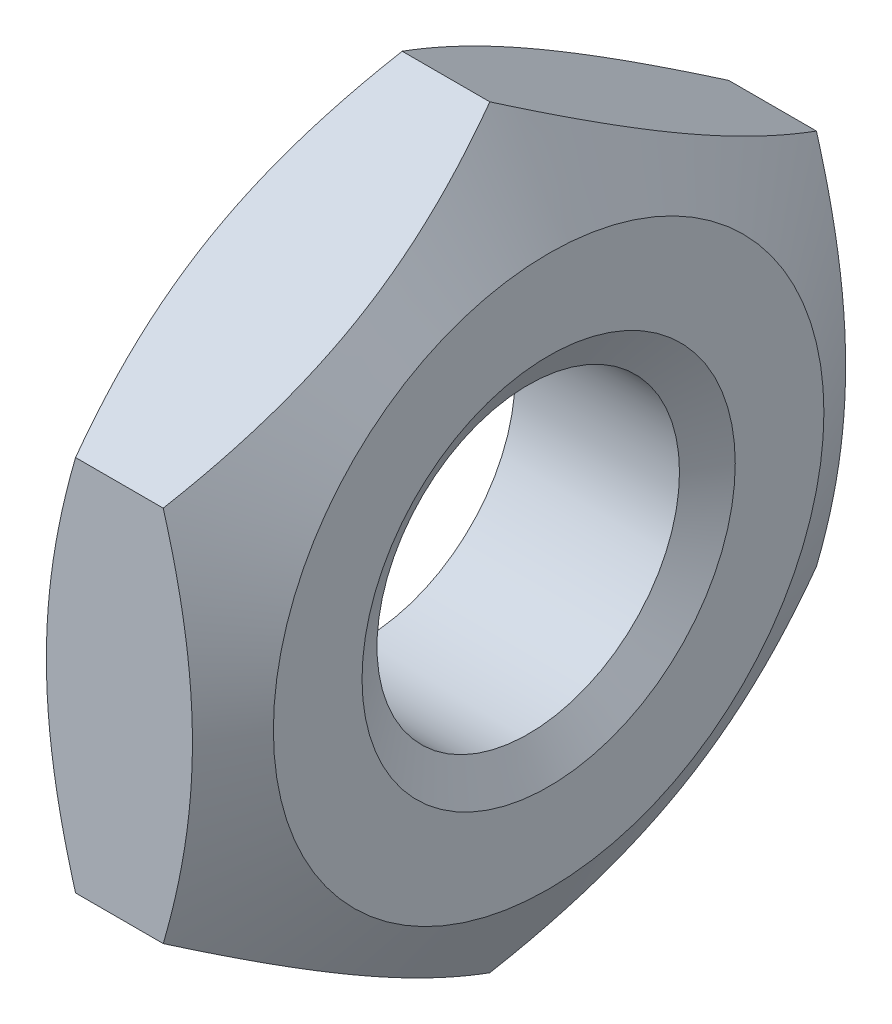
ISO-10303-21;
HEADER;
FILE_DESCRIPTION(('STEP AP214'),'2;1');
FILE_NAME('part.step','',(''),(''),'','','');
FILE_SCHEMA(('AUTOMOTIVE_DESIGN { 1 0 10303 214 1 1 1 1 }'));
ENDSEC;
DATA;
#1=APPLICATION_CONTEXT('core data for automotive mechanical design processes');
#2=APPLICATION_PROTOCOL_DEFINITION('international standard','automotive_design',2000,#1);
#3=PRODUCT_CONTEXT('',#1,'mechanical');
#4=PRODUCT('Part','Part','',(#3));
#5=PRODUCT_RELATED_PRODUCT_CATEGORY('part','',(#4));
#6=PRODUCT_DEFINITION_FORMATION('','',#4);
#7=PRODUCT_DEFINITION_CONTEXT('part definition',#1,'design');
#8=PRODUCT_DEFINITION('design','',#6,#7);
#9=PRODUCT_DEFINITION_SHAPE('','',#8);
#10=(LENGTH_UNIT() NAMED_UNIT(*) SI_UNIT(.MILLI.,.METRE.));
#11=(NAMED_UNIT(*) PLANE_ANGLE_UNIT() SI_UNIT($,.RADIAN.));
#12=(NAMED_UNIT(*) SI_UNIT($,.STERADIAN.) SOLID_ANGLE_UNIT());
#13=UNCERTAINTY_MEASURE_WITH_UNIT(LENGTH_MEASURE(1.E-05),#10,'distance_accuracy_value','');
#14=(GEOMETRIC_REPRESENTATION_CONTEXT(3) GLOBAL_UNCERTAINTY_ASSIGNED_CONTEXT((#13)) GLOBAL_UNIT_ASSIGNED_CONTEXT((#10,
#11,#12)) REPRESENTATION_CONTEXT('',''));
#15=CARTESIAN_POINT('',(0.,0.,0.));
#16=DIRECTION('',(0.,0.,1.));
#17=DIRECTION('',(1.,0.,0.));
#18=AXIS2_PLACEMENT_3D('',#15,#16,#17);
#19=CARTESIAN_POINT('',(0.,0.,0.));
#20=DIRECTION('',(1.,0.,0.));
#21=DIRECTION('',(0.,0.,-1.));
#22=AXIS2_PLACEMENT_3D('',#19,#20,#21);
#23=PLANE('',#22);
#24=CARTESIAN_POINT('',(5.68435272810253E-11,0.,0.));
#25=DIRECTION('',(1.,0.,0.));
#26=DIRECTION('',(0.,0.,-1.));
#27=AXIS2_PLACEMENT_3D('',#24,#25,#26);
#28=CIRCLE('',#27,2.9500000000553);
#29=CARTESIAN_POINT('',(5.68435272810253E-11,0.,-2.9500000000553));
#30=VERTEX_POINT('',#29);
#31=EDGE_CURVE('E241',#30,#30,#28,.T.);
#32=ORIENTED_EDGE('',*,*,#31,.F.);
#33=EDGE_LOOP('',(#32));
#34=FACE_BOUND('',#33,.T.);
#35=CARTESIAN_POINT('',(8.08682745444577E-11,0.,0.));
#36=DIRECTION('',(-1.,0.,0.));
#37=DIRECTION('',(0.,0.,1.));
#38=AXIS2_PLACEMENT_3D('',#35,#36,#37);
#39=CIRCLE('',#38,1.99988611427671);
#40=CARTESIAN_POINT('',(8.08682745444577E-11,0.,1.99988611427671));
#41=VERTEX_POINT('',#40);
#42=EDGE_CURVE('E20',#41,#41,#39,.F.);
#43=ORIENTED_EDGE('',*,*,#42,.T.);
#44=EDGE_LOOP('',(#43));
#45=FACE_BOUND('',#44,.T.);
#46=ADVANCED_FACE('F17',(#34,#45),#23,.F.);
#47=CARTESIAN_POINT('',(1.13686837721616E-10,0.,0.));
#48=DIRECTION('',(-1.,0.,0.));
#49=DIRECTION('',(0.,0.,1.));
#50=AXIS2_PLACEMENT_3D('',#47,#48,#49);
#51=CONICAL_SURFACE('',#50,1.99988611421986,1.04719755124657);
#52=CARTESIAN_POINT('',(0.21875,0.,0.));
#53=DIRECTION('',(1.,0.,0.));
#54=DIRECTION('',(0.,0.,-1.));
#55=AXIS2_PLACEMENT_3D('',#52,#53,#54);
#56=CIRCLE('',#55,1.621);
#57=CARTESIAN_POINT('',(0.21875,0.,-1.621));
#58=VERTEX_POINT('',#57);
#59=EDGE_CURVE('E79',#58,#58,#56,.T.);
#60=ORIENTED_EDGE('',*,*,#59,.T.);
#61=EDGE_LOOP('',(#60));
#62=FACE_BOUND('',#61,.T.);
#63=ORIENTED_EDGE('',*,*,#42,.F.);
#64=EDGE_LOOP('',(#63));
#65=FACE_BOUND('',#64,.T.);
#66=ADVANCED_FACE('F122',(#62,#65),#51,.F.);
#67=CARTESIAN_POINT('',(0.633930949163641,0.,0.));
#68=DIRECTION('',(1.,0.,0.));
#69=DIRECTION('',(0.,0.,-1.));
#70=AXIS2_PLACEMENT_3D('',#67,#68,#69);
#71=CONICAL_SURFACE('',#70,4.04800061238575,1.04719755119152);
#72=ORIENTED_EDGE('',*,*,#31,.T.);
#73=EDGE_LOOP('',(#72));
#74=FACE_BOUND('',#73,.T.);
#75=CARTESIAN_POINT('',(0.630150019873225,-2.02072597573608,3.49999994185093));
#76=CARTESIAN_POINT('',(0.57886722542595,-2.10952464238799,3.34619613956544));
#77=CARTESIAN_POINT('',(0.532228208061546,-2.1990898178685,3.19106470504437));
#78=CARTESIAN_POINT('',(0.450821204582486,-2.37977092988754,2.87811583905935));
#79=CARTESIAN_POINT('',(0.416082014035801,-2.47089007573442,2.72029284891028));
#80=CARTESIAN_POINT('',(0.362007960202235,-2.65199917350881,2.40660268985207));
#81=CARTESIAN_POINT('',(0.342313162136094,-2.74196126728799,2.25078377267126));
#82=CARTESIAN_POINT('',(0.318806081532153,-2.92230853530629,1.93841314145732));
#83=CARTESIAN_POINT('',(0.314974328427329,-3.01269305448204,1.78186256202724));
#84=CARTESIAN_POINT('',(0.322966049601793,-3.18156683263471,1.4893645982007));
#85=CARTESIAN_POINT('',(0.332827292240821,-3.2600814325054,1.35337332208872));
#86=CARTESIAN_POINT('',(0.364075321732847,-3.41659913519978,1.0822767087381));
#87=CARTESIAN_POINT('',(0.385472772403142,-3.49460169707456,0.947172308450446));
#88=CARTESIAN_POINT('',(0.438962256844171,-3.65144184092593,0.675517210633458));
#89=CARTESIAN_POINT('',(0.471280923239372,-3.73025958267919,0.539000877378963));
#90=CARTESIAN_POINT('',(0.544630632301261,-3.88671983956512,0.268003763087252));
#91=CARTESIAN_POINT('',(0.585644451768904,-3.96436435758831,0.133519512941888));
#92=CARTESIAN_POINT('',(0.630150051964935,-4.04145190633947,-3.81260597543293E-08));
#93=B_SPLINE_CURVE_WITH_KNOTS('',3,(#75,#76,#77,#78,#79,#80,#81,#82,#83,#84,#85,#86,#87,#88,#89,
#90,#91,#92),.UNSPECIFIED.,.F.,.F.,(4,2,2,2,2,2,2,2,4),(0.,0.554778015740783,1.1108891707186,
1.65323829741714,2.19492153798874,2.66648860046754,3.13849231843832,3.62096281697966,
4.1024864295983),.UNSPECIFIED.);
#94=CARTESIAN_POINT('',(0.630150027159322,-2.02072595061728,3.49999997092546));
#95=VERTEX_POINT('',#94);
#96=CARTESIAN_POINT('',(0.630150028141627,-4.04145186507629,-7.87479155328805E-08));
#97=VERTEX_POINT('',#96);
#98=EDGE_CURVE('E68',#95,#97,#93,.T.);
#99=ORIENTED_EDGE('',*,*,#98,.F.);
#100=CARTESIAN_POINT('',(0.63015000186848,2.02072581269268,3.5));
#101=CARTESIAN_POINT('',(0.58225911178957,1.85484426024393,3.49999999999988));
#102=CARTESIAN_POINT('',(0.538413649345164,1.68765043795482,3.49999999999994));
#103=CARTESIAN_POINT('',(0.460922233844514,1.35054684606015,3.50000000000006));
#104=CARTESIAN_POINT('',(0.427299101562756,1.18063187830983,3.50000000000012));
#105=CARTESIAN_POINT('',(0.373229035313504,0.842708540356711,3.49999999999988));
#106=CARTESIAN_POINT('',(0.352493822382226,0.674747747060822,3.49999999999959));
#107=CARTESIAN_POINT('',(0.324658028718863,0.337857134419642,3.50000000000041));
#108=CARTESIAN_POINT('',(0.317542648079603,0.168928567212653,3.50000000000153));
#109=CARTESIAN_POINT('',(0.317542648084503,-0.168928579896468,3.50000000000153));
#110=CARTESIAN_POINT('',(0.324658029797163,-0.337857159798601,3.50000000000041));
#111=CARTESIAN_POINT('',(0.352493827580674,-0.674747797618393,3.49999999999959));
#112=CARTESIAN_POINT('',(0.373229043563721,-0.84270860339722,3.49999999999988));
#113=CARTESIAN_POINT('',(0.427299117562597,-1.18063196653167,3.50000000000012));
#114=CARTESIAN_POINT('',(0.46092225460139,-1.35054694696722,3.50000000000006));
#115=CARTESIAN_POINT('',(0.538413680694909,-1.68765056372788,3.49999999999994));
#116=CARTESIAN_POINT('',(0.582259148967907,-1.85484439819971,3.49999999999988));
#117=CARTESIAN_POINT('',(0.630150045168041,-2.02072596264274,3.5));
#118=B_SPLINE_CURVE_WITH_KNOTS('',3,(#100,#101,#102,#103,#104,#105,#106,#107,#108,#109,#110,
#111,#112,#113,#114,#115,#116,#117),.UNSPECIFIED.,.F.,.F.,(4,2,2,2,2,2,2,2,4),(0.,
0.51812840840919,1.03740515645203,1.54460390147184,2.05125118851018,2.55789851358957,
3.06509729679909,3.58437408488947,4.10250253301621),.UNSPECIFIED.);
#119=CARTESIAN_POINT('',(0.630150028123766,2.02072586432045,3.50000002270327));
#120=VERTEX_POINT('',#119);
#121=EDGE_CURVE('E73',#120,#95,#118,.T.);
#122=ORIENTED_EDGE('',*,*,#121,.F.);
#123=CARTESIAN_POINT('',(0.630150001886468,4.04145181962303,1.12071223443324E-07));
#124=CARTESIAN_POINT('',(0.578867208910861,3.95265315348652,0.153803913464005));
#125=CARTESIAN_POINT('',(0.532228193110794,3.8630879785247,0.308935347086682));
#126=CARTESIAN_POINT('',(0.450821192880933,3.68240686759348,0.621884211187538));
#127=CARTESIAN_POINT('',(0.41608200401724,3.59128772231606,0.779707200350279));
#128=CARTESIAN_POINT('',(0.362007953521486,3.4101786256795,1.09339735743771));
#129=CARTESIAN_POINT('',(0.342313157116794,3.32021653246665,1.24921627363761));
#130=CARTESIAN_POINT('',(0.31880607971975,3.13986926564727,1.56158690277496));
#131=CARTESIAN_POINT('',(0.314974328161562,3.04948474710398,1.71813748110958));
#132=CARTESIAN_POINT('',(0.322966051903708,2.88061097159494,2.01063544035723));
#133=CARTESIAN_POINT('',(0.332827295378414,2.80209637372482,2.14662671300411));
#134=CARTESIAN_POINT('',(0.364075325872298,2.64557867503806,2.41772331941332));
#135=CARTESIAN_POINT('',(0.385472776707306,2.56757611517029,2.55282771622473));
#136=CARTESIAN_POINT('',(0.43896226086037,2.41073597540436,2.82448280696553));
#137=CARTESIAN_POINT('',(0.471280926781289,2.33191823572802,2.9609991366227));
#138=CARTESIAN_POINT('',(0.544630634400719,2.1754579829319,3.23199624383064));
#139=CARTESIAN_POINT('',(0.585644452902166,2.09781346692183,3.36648049048918));
#140=CARTESIAN_POINT('',(0.63015005195197,2.02072592015204,3.50000003812529));
#141=B_SPLINE_CURVE_WITH_KNOTS('',3,(#123,#124,#125,#126,#127,#128,#129,#130,#131,#132,#133,
#134,#135,#136,#137,#138,#139,#140),.UNSPECIFIED.,.F.,.F.,(4,2,2,2,2,2,2,2,4),(0.,
0.554778011538827,1.11088916220597,1.65323828498337,2.19492152167452,2.66648857237143,
3.13849227851482,3.62096276458722,4.10248636481662),.UNSPECIFIED.);
#142=CARTESIAN_POINT('',(0.63015002813126,4.04145186508035,7.87343799137493E-08));
#143=VERTEX_POINT('',#142);
#144=EDGE_CURVE('E92',#143,#120,#141,.T.);
#145=ORIENTED_EDGE('',*,*,#144,.F.);
#146=CARTESIAN_POINT('',(0.630150028864758,2.02072596014027,-3.49999996886365));
#147=CARTESIAN_POINT('',(0.578867233681929,2.10952462705014,-3.34619616613137));
#148=CARTESIAN_POINT('',(0.532228215535409,2.19908980279021,-3.19106473116074));
#149=CARTESIAN_POINT('',(0.450821210431326,2.37977091535353,-2.878115864233));
#150=CARTESIAN_POINT('',(0.416082019042669,2.47089006148529,-2.7202928735905));
#151=CARTESIAN_POINT('',(0.362007963538628,2.65199915982898,-2.40660271354623));
#152=CARTESIAN_POINT('',(0.342313164640702,2.74196125389156,-2.25078379587456));
#153=CARTESIAN_POINT('',(0.318806082430693,2.92230852250983,-1.93841316362144));
#154=CARTESIAN_POINT('',(0.314974328550994,3.01269304200209,-1.78186258364315));
#155=CARTESIAN_POINT('',(0.322966048438468,3.18156682147876,-1.48936461752337));
#156=CARTESIAN_POINT('',(0.332827290658354,3.26008142235165,-1.35337333967554));
#157=CARTESIAN_POINT('',(0.364075319647163,3.41659912705369,-1.08227672284754));
#158=CARTESIAN_POINT('',(0.385472770234115,3.49460168993391,-0.947172320818403));
#159=CARTESIAN_POINT('',(0.438962254817436,3.65144183583192,-0.675517219456544));
#160=CARTESIAN_POINT('',(0.471280921449076,3.73025957862561,-0.539000884399977));
#161=CARTESIAN_POINT('',(0.54463063123106,3.88671983756039,-0.268003766559549));
#162=CARTESIAN_POINT('',(0.585644451181367,3.96436435659212,-0.133519514667353));
#163=CARTESIAN_POINT('',(0.630150051950186,4.04145190633594,3.81199391362641E-08));
#164=B_SPLINE_CURVE_WITH_KNOTS('',3,(#146,#147,#148,#149,#150,#151,#152,#153,#154,#155,#156,
#157,#158,#159,#160,#161,#162,#163),.UNSPECIFIED.,.F.,.F.,(4,2,2,2,2,2,2,2,4),(0.,
0.554778017842987,1.11088917497737,1.65323830363826,2.19492154615188,2.66648861453277,
3.1384923384284,3.62096284321534,4.10248646203972),.UNSPECIFIED.);
#165=CARTESIAN_POINT('',(0.630150036812038,2.02072596070559,-3.49999998443183));
#166=VERTEX_POINT('',#165);
#167=EDGE_CURVE('E222',#166,#143,#164,.T.);
#168=ORIENTED_EDGE('',*,*,#167,.F.);
#169=CARTESIAN_POINT('',(0.630150001886247,-2.02072581271019,-3.50000000000001));
#170=CARTESIAN_POINT('',(0.582259111792223,-1.85484426026407,-3.50000000000011));
#171=CARTESIAN_POINT('',(0.538413649341786,-1.68765043797529,-3.50000000000006));
#172=CARTESIAN_POINT('',(0.460922233836957,-1.35054684607977,-3.49999999999996));
#173=CARTESIAN_POINT('',(0.427299101557037,-1.18063187832827,-3.49999999999991));
#174=CARTESIAN_POINT('',(0.373229035308382,-0.84270854037137,-3.5000000000001));
#175=CARTESIAN_POINT('',(0.352493822376075,-0.674747747072838,-3.50000000000034));
#176=CARTESIAN_POINT('',(0.32465802871287,-0.337857134425841,-3.49999999999967));
#177=CARTESIAN_POINT('',(0.317542648074819,-0.168928567215678,-3.49999999999876));
#178=CARTESIAN_POINT('',(0.317542648079688,0.168928579606615,-3.49999999999876));
#179=CARTESIAN_POINT('',(0.324658029766439,0.337857159218744,-3.49999999999967));
#180=CARTESIAN_POINT('',(0.35249382745432,0.674747796463062,-3.50000000000034));
#181=CARTESIAN_POINT('',(0.373229043367513,0.842708601956434,-3.5000000000001));
#182=CARTESIAN_POINT('',(0.427299117188043,1.18063196451294,-3.4999999999999));
#183=CARTESIAN_POINT('',(0.460922254116812,1.35054694465632,-3.49999999999995));
#184=CARTESIAN_POINT('',(0.538413679965384,1.68765056084472,-3.50000000000005));
#185=CARTESIAN_POINT('',(0.582259148103648,1.85484439503639,-3.5000000000001));
#186=CARTESIAN_POINT('',(0.630150044162541,2.02072595920361,-3.5));
#187=B_SPLINE_CURVE_WITH_KNOTS('',3,(#169,#170,#171,#172,#173,#174,#175,#176,#177,#178,#179,
#180,#181,#182,#183,#184,#185,#186),.UNSPECIFIED.,.F.,.F.,(4,2,2,2,2,2,2,2,4),(0.,
0.518128408412838,1.03740515645781,1.54460390148599,2.05125118853351,2.55789851274368,
3.06509729507982,3.58437408224762,4.10250252946053),.UNSPECIFIED.);
#188=CARTESIAN_POINT('',(0.63015002813678,-2.02072586433305,-3.5000000226966));
#189=VERTEX_POINT('',#188);
#190=EDGE_CURVE('E139',#189,#166,#187,.T.);
#191=ORIENTED_EDGE('',*,*,#190,.F.);
#192=CARTESIAN_POINT('',(0.630150001892323,-4.04145181961116,-1.12091781681471E-07));
#193=CARTESIAN_POINT('',(0.578867208916153,-3.95265315347469,-0.153803913484493));
#194=CARTESIAN_POINT('',(0.53222819311565,-3.86308797851288,-0.308935347107153));
#195=CARTESIAN_POINT('',(0.450821192885237,-3.68240686758163,-0.621884211208059));
#196=CARTESIAN_POINT('',(0.416082004021429,-3.59128772230417,-0.779707200370868));
#197=CARTESIAN_POINT('',(0.36200795352586,-3.41017862566757,-1.09339735745836));
#198=CARTESIAN_POINT('',(0.342313157121447,-3.32021653245473,-1.24921627365825));
#199=CARTESIAN_POINT('',(0.318806079725322,-3.13986926563537,-1.56158690279556));
#200=CARTESIAN_POINT('',(0.314974328167773,-3.0494847470921,-1.71813748113015));
#201=CARTESIAN_POINT('',(0.322966051911321,-2.88061097158463,-2.01063544037508));
#202=CARTESIAN_POINT('',(0.332827295386519,-2.80209637371605,-2.14662671301929));
#203=CARTESIAN_POINT('',(0.364075325881126,-2.6455786750324,-2.41772331942313));
#204=CARTESIAN_POINT('',(0.385472776716366,-2.56757611516618,-2.55282771623185));
#205=CARTESIAN_POINT('',(0.438962260869673,-2.41073597540337,-2.82448280696724));
#206=CARTESIAN_POINT('',(0.471280926790603,-2.3319182357286,-2.96099913662169));
#207=CARTESIAN_POINT('',(0.544630634409875,-2.17545798293561,-3.2319962438242));
#208=CARTESIAN_POINT('',(0.585644452911155,-2.0978134669271,-3.36648049048004));
#209=CARTESIAN_POINT('',(0.63015005196073,-2.02072592015888,-3.50000003811345));
#210=B_SPLINE_CURVE_WITH_KNOTS('',3,(#192,#193,#194,#195,#196,#197,#198,#199,#200,#201,#202,
#203,#204,#205,#206,#207,#208,#209),.UNSPECIFIED.,.F.,.F.,(4,2,2,2,2,2,2,2,4),(0.,
0.554778011539071,1.11088916220648,1.65323828498373,2.19492152167469,2.66648857236248,
3.13849227849672,3.62096276455992,4.10248636478013),.UNSPECIFIED.);
#211=EDGE_CURVE('E75',#97,#189,#210,.T.);
#212=ORIENTED_EDGE('',*,*,#211,.F.);
#213=EDGE_LOOP('',(#99,#122,#145,#168,#191,#212));
#214=FACE_BOUND('',#213,.T.);
#215=ADVANCED_FACE('F70',(#74,#214),#71,.T.);
#216=CARTESIAN_POINT('',(-8.71665394401295,0.,0.));
#217=DIRECTION('',(1.,0.,0.));
#218=DIRECTION('',(0.,0.,-1.));
#219=AXIS2_PLACEMENT_3D('',#216,#217,#218);
#220=CYLINDRICAL_SURFACE('',#219,1.621);
#221=ORIENTED_EDGE('',*,*,#59,.F.);
#222=EDGE_LOOP('',(#221));
#223=FACE_BOUND('',#222,.T.);
#224=CARTESIAN_POINT('',(1.98124999997162,0.,0.));
#225=DIRECTION('',(1.,0.,0.));
#226=DIRECTION('',(0.,0.,-1.));
#227=AXIS2_PLACEMENT_3D('',#224,#225,#226);
#228=CIRCLE('',#227,1.62100000000009);
#229=CARTESIAN_POINT('',(1.98124999997162,0.,-1.62100000000009));
#230=VERTEX_POINT('',#229);
#231=EDGE_CURVE('E88',#230,#230,#228,.T.);
#232=ORIENTED_EDGE('',*,*,#231,.T.);
#233=EDGE_LOOP('',(#232));
#234=FACE_BOUND('',#233,.T.);
#235=ADVANCED_FACE('F121',(#223,#234),#220,.F.);
#236=CARTESIAN_POINT('',(0.,-4.04145188432738,0.));
#237=DIRECTION('',(0.,-0.866025403784439,0.5));
#238=DIRECTION('',(0.,-0.5,-0.866025403784439));
#239=AXIS2_PLACEMENT_3D('',#236,#237,#238);
#240=PLANE('',#239);
#241=ORIENTED_EDGE('',*,*,#98,.T.);
#242=DIRECTION('',(1.,0.,0.));
#243=VECTOR('',#242,1.);
#244=CARTESIAN_POINT('',(0.,-4.0414518967542,2.15238833700671E-08));
#245=LINE('',#244,#243);
#246=CARTESIAN_POINT('',(1.56984994480841,-4.04145191197825,4.78927119418374E-08));
#247=VERTEX_POINT('',#246);
#248=EDGE_CURVE('E78',#247,#97,#245,.F.);
#249=ORIENTED_EDGE('',*,*,#248,.F.);
#250=CARTESIAN_POINT('',(1.56984990407992,-2.02072585813098,3.50000003984258));
#251=CARTESIAN_POINT('',(1.62113272359888,-2.1095245541695,3.34619625439936));
#252=CARTESIAN_POINT('',(1.66777175393474,-2.19908974334397,3.19106482394939));
#253=CARTESIAN_POINT('',(1.74917877241104,-2.37977086888374,2.87811595492074));
#254=CARTESIAN_POINT('',(1.78391796497528,-2.47089001452231,2.72029295763295));
#255=CARTESIAN_POINT('',(1.83799202515742,-2.6519991154734,2.406602787739));
#256=CARTESIAN_POINT('',(1.85768682754238,-2.74196121253735,2.25078386680017));
#257=CARTESIAN_POINT('',(1.88119391531152,-2.92230848637842,1.93841322690399));
#258=CARTESIAN_POINT('',(1.88502567125393,-3.01269300809349,1.78186264255038));
#259=CARTESIAN_POINT('',(1.87703395489685,-3.18156678483169,1.4893646808449));
#260=CARTESIAN_POINT('',(1.86717271535917,-3.26008138071645,1.35337341174856));
#261=CARTESIAN_POINT('',(1.83592469297934,-3.41659907548116,1.08227681221507));
#262=CARTESIAN_POINT('',(1.81452724632838,-3.49460163341268,0.947172418727954));
#263=CARTESIAN_POINT('',(1.76103777060843,-3.65144176952321,0.675517334294424));
#264=CARTESIAN_POINT('',(1.72871910892008,-3.73025950748188,0.539001007618443));
#265=CARTESIAN_POINT('',(1.65536940954938,-3.88671975699653,0.26800390610632));
#266=CARTESIAN_POINT('',(1.61435559505581,-3.96436427144166,0.133519662164394));
#267=CARTESIAN_POINT('',(1.56984999984541,-4.04145181665136,1.17218301845483E-07));
#268=B_SPLINE_CURVE_WITH_KNOTS('',3,(#250,#251,#252,#253,#254,#255,#256,#257,#258,#259,#260,
#261,#262,#263,#264,#265,#266,#267),.UNSPECIFIED.,.F.,.F.,(4,2,2,2,2,2,2,2,4),(0.,
0.554778035116627,1.11088920868455,1.65323835163227,2.19492160879559,2.6664886466322,
3.13849233962503,3.62096281302447,4.10248640108038),.UNSPECIFIED.);
#269=CARTESIAN_POINT('',(1.56984995080232,-2.02072591239567,3.50000003712724));
#270=VERTEX_POINT('',#269);
#271=EDGE_CURVE('E86',#270,#247,#268,.T.);
#272=ORIENTED_EDGE('',*,*,#271,.F.);
#273=DIRECTION('',(1.,0.,0.));
#274=VECTOR('',#273,1.);
#275=CARTESIAN_POINT('',(0.,-2.02072592549849,3.5));
#276=LINE('',#275,#274);
#277=EDGE_CURVE('E83',#95,#270,#276,.T.);
#278=ORIENTED_EDGE('',*,*,#277,.F.);
#279=EDGE_LOOP('',(#241,#249,#272,#278));
#280=FACE_BOUND('',#279,.T.);
#281=ADVANCED_FACE('F84',(#280),#240,.T.);
#282=CARTESIAN_POINT('',(0.,-2.02072594216368,-3.50000000000001));
#283=DIRECTION('',(0.,-0.866025403784438,-0.500000000000001));
#284=DIRECTION('',(0.,0.500000000000001,-0.866025403784438));
#285=AXIS2_PLACEMENT_3D('',#282,#283,#284);
#286=PLANE('',#285);
#287=ORIENTED_EDGE('',*,*,#211,.T.);
#288=DIRECTION('',(1.,0.,0.));
#289=VECTOR('',#288,1.);
#290=CARTESIAN_POINT('',(0.,-2.02072596700637,-3.50000000000001));
#291=LINE('',#290,#289);
#292=CARTESIAN_POINT('',(1.56984994481477,-2.02072599744337,-3.50000000000001));
#293=VERTEX_POINT('',#292);
#294=EDGE_CURVE('E138',#293,#189,#291,.F.);
#295=ORIENTED_EDGE('',*,*,#294,.F.);
#296=CARTESIAN_POINT('',(1.56984990781656,-4.04145188271749,9.05441111742603E-08));
#297=CARTESIAN_POINT('',(1.62113272482146,-3.9526532417726,-0.153803727027165));
#298=CARTESIAN_POINT('',(1.66777175408671,-3.86308807530491,-0.308935170474271));
#299=CARTESIAN_POINT('',(1.74917877173867,-3.68240696662238,-0.621884048670197));
#300=CARTESIAN_POINT('',(1.78391796454966,-3.59128781506526,-0.779707042088042));
#301=CARTESIAN_POINT('',(1.83799202495033,-3.41017871008134,-1.09339720892432));
#302=CARTESIAN_POINT('',(1.85768682730918,-3.32021661471247,-1.24921613056387));
#303=CARTESIAN_POINT('',(1.88119391516382,-3.13986934227367,-1.56158677067317));
#304=CARTESIAN_POINT('',(1.88502567121916,-3.04948482026827,-1.71813735454055));
#305=CARTESIAN_POINT('',(1.87703395507902,-2.88061104323545,-2.01063531613707));
#306=CARTESIAN_POINT('',(1.86717271559979,-2.80209644727908,-2.14662658556796));
#307=CARTESIAN_POINT('',(1.83592469328707,-2.64557875225165,-2.41772318571192));
#308=CARTESIAN_POINT('',(1.81452724664393,-2.56757619412896,-2.55282757947483));
#309=CARTESIAN_POINT('',(1.76103777089482,-2.41073605767928,-2.82448266445045));
#310=CARTESIAN_POINT('',(1.72871910917047,-2.33191831957314,-2.9609989913933));
#311=CARTESIAN_POINT('',(1.6553694096949,-2.17545806977509,-3.23199609341917));
#312=CARTESIAN_POINT('',(1.61435559513337,-2.09781355519391,-3.36648033760815));
#313=CARTESIAN_POINT('',(1.56984999984307,-2.02072600983564,-3.49999988278873));
#314=B_SPLINE_CURVE_WITH_KNOTS('',3,(#296,#297,#298,#299,#300,#301,#302,#303,#304,#305,#306,
#307,#308,#309,#310,#311,#312,#313),.UNSPECIFIED.,.F.,.F.,(4,2,2,2,2,2,2,2,4),(0.,
0.554778034034858,1.1108892066415,1.65323834883577,2.19492160519582,2.66648864398884,
3.13849233797079,3.62096281228576,4.10248640120925),.UNSPECIFIED.);
#315=EDGE_CURVE('E154',#247,#293,#314,.T.);
#316=ORIENTED_EDGE('',*,*,#315,.F.);
#317=ORIENTED_EDGE('',*,*,#248,.T.);
#318=EDGE_LOOP('',(#287,#295,#316,#317));
#319=FACE_BOUND('',#318,.T.);
#320=ADVANCED_FACE('F145',(#319),#286,.T.);
#321=CARTESIAN_POINT('',(0.,2.0207259421637,-3.5));
#322=DIRECTION('',(0.,0.,-1.));
#323=DIRECTION('',(0.,1.,0.));
#324=AXIS2_PLACEMENT_3D('',#321,#322,#323);
#325=PLANE('',#324);
#326=DIRECTION('',(1.,0.,0.));
#327=VECTOR('',#326,1.);
#328=CARTESIAN_POINT('',(0.,2.02072592974054,-3.50000002151754));
#329=LINE('',#328,#327);
#330=CARTESIAN_POINT('',(1.56984994479778,2.02072591451642,-3.50000004788649));
#331=VERTEX_POINT('',#330);
#332=EDGE_CURVE('E228',#331,#166,#329,.F.);
#333=ORIENTED_EDGE('',*,*,#332,.F.);
#334=CARTESIAN_POINT('',(1.56984990782328,-2.02072601973827,-3.49999995332904));
#335=CARTESIAN_POINT('',(1.61774082496783,-1.85484445449361,-3.49999998323739));
#336=CARTESIAN_POINT('',(1.66158630330581,-1.68765061634002,-3.49999999550729));
#337=CARTESIAN_POINT('',(1.73907773949511,-1.3505469898078,-3.50000000450269));
#338=CARTESIAN_POINT('',(1.77270087655755,-1.18063200328001,-3.50000000119369));
#339=CARTESIAN_POINT('',(1.82677095234893,-0.842708629132893,-3.49999999883409));
#340=CARTESIAN_POINT('',(1.84750617009728,-0.67474781842883,-3.49999999968624));
#341=CARTESIAN_POINT('',(1.87534196996221,-0.337857170380506,-3.50000000031343));
#342=CARTESIAN_POINT('',(1.88245735198399,-0.168928585174652,-3.50000000008964));
#343=CARTESIAN_POINT('',(1.88245735188949,0.168928566562434,-3.49999999992248));
#344=CARTESIAN_POINT('',(1.87534197134113,0.337857133093666,-3.49999999997911));
#345=CARTESIAN_POINT('',(1.84750617792619,0.674747744321545,-3.50000000002093));
#346=CARTESIAN_POINT('',(1.82677096515961,0.842708536880519,-3.50000000000604));
#347=CARTESIAN_POINT('',(1.77270089928579,1.18063187374424,-3.49999999999382));
#348=CARTESIAN_POINT('',(1.7390777671892,1.35054684113791,-3.49999999999691));
#349=CARTESIAN_POINT('',(1.66158635204773,1.68765043246139,-3.50000000000308));
#350=CARTESIAN_POINT('',(1.61774088976933,1.85484425453409,-3.50000000000615));
#351=CARTESIAN_POINT('',(1.56984999984482,2.02072580676969,-3.5));
#352=B_SPLINE_CURVE_WITH_KNOTS('',3,(#334,#335,#336,#337,#338,#339,#340,#341,#342,#343,#344,
#345,#346,#347,#348,#349,#350,#351),.UNSPECIFIED.,.F.,.F.,(4,2,2,2,2,2,2,2,4),(0.,
0.518128466390621,1.03740527203046,1.54460407072429,2.05125141159075,2.5578986966358,
3.06509743939546,3.58437418628447,4.10250259394283),.UNSPECIFIED.);
#353=EDGE_CURVE('E161',#293,#331,#352,.T.);
#354=ORIENTED_EDGE('',*,*,#353,.F.);
#355=ORIENTED_EDGE('',*,*,#294,.T.);
#356=ORIENTED_EDGE('',*,*,#190,.T.);
#357=EDGE_LOOP('',(#333,#354,#355,#356));
#358=FACE_BOUND('',#357,.T.);
#359=ADVANCED_FACE('F148',(#358),#325,.T.);
#360=CARTESIAN_POINT('',(0.,4.04145188432738,0.));
#361=DIRECTION('',(0.,0.866025403784439,-0.499999999999999));
#362=DIRECTION('',(0.,0.499999999999999,0.866025403784439));
#363=AXIS2_PLACEMENT_3D('',#360,#361,#362);
#364=PLANE('',#363);
#365=ORIENTED_EDGE('',*,*,#167,.T.);
#366=DIRECTION('',(1.,0.,0.));
#367=VECTOR('',#366,1.);
#368=CARTESIAN_POINT('',(0.,4.04145187599824,1.44264921189685E-08));
#369=LINE('',#368,#367);
#370=CARTESIAN_POINT('',(1.56984995539868,4.04145189361335,-1.60837615429189E-08));
#371=VERTEX_POINT('',#370);
#372=EDGE_CURVE('E227',#371,#143,#369,.F.);
#373=ORIENTED_EDGE('',*,*,#372,.F.);
#374=CARTESIAN_POINT('',(1.56984990779407,2.02072586293355,-3.50000004385901));
#375=CARTESIAN_POINT('',(1.62113272481357,2.10952455569735,-3.34619625618312));
#376=CARTESIAN_POINT('',(1.66777175408779,2.1990897434293,-3.19106482498894));
#377=CARTESIAN_POINT('',(1.74917877175085,2.3797708677177,-2.87811595575019));
#378=CARTESIAN_POINT('',(1.78391796456379,2.47089001355163,-2.72029295899914));
#379=CARTESIAN_POINT('',(1.83799202495779,2.65199911445951,-2.40660278980239));
#380=CARTESIAN_POINT('',(1.85768682731156,2.74196121129583,-2.25078386903246));
#381=CARTESIAN_POINT('',(1.88119391515946,2.92230848478655,-1.93841322957938));
#382=CARTESIAN_POINT('',(1.88502567121331,3.01269300637871,-1.78186264549995));
#383=CARTESIAN_POINT('',(1.8770339549479,3.18156678574365,-1.4893646792832));
#384=CARTESIAN_POINT('',(1.867172714938,3.2600813843751,-1.3533734054164));
#385=CARTESIAN_POINT('',(1.83592469083471,3.41659908460174,-1.08227679641295));
#386=CARTESIAN_POINT('',(1.81452724292995,3.49460164524836,-0.947172398226576));
#387=CARTESIAN_POINT('',(1.76103776403537,3.65144178683144,-0.675517304317104));
#388=CARTESIAN_POINT('',(1.72871910040437,3.73025952754513,-0.539000972868589));
#389=CARTESIAN_POINT('',(1.65536939670101,3.88671978246353,-0.268003861995475));
#390=CARTESIAN_POINT('',(1.61435557982085,3.96436429955785,-0.133519613464316));
#391=CARTESIAN_POINT('',(1.56984998209143,4.04145184738015,-6.3994479617773E-08));
#392=B_SPLINE_CURVE_WITH_KNOTS('',3,(#374,#375,#376,#377,#378,#379,#380,#381,#382,#383,#384,
#385,#386,#387,#388,#389,#390,#391),.UNSPECIFIED.,.F.,.F.,(4,2,2,2,2,2,2,2,4),(0.,
0.554778034101835,1.11088920678312,1.65323834891739,2.19492160521178,2.66648865956445,
3.13849236916353,3.62096285990745,4.10248646513488),.UNSPECIFIED.);
#393=EDGE_CURVE('E209',#331,#371,#392,.T.);
#394=ORIENTED_EDGE('',*,*,#393,.F.);
#395=ORIENTED_EDGE('',*,*,#332,.T.);
#396=EDGE_LOOP('',(#365,#373,#394,#395));
#397=FACE_BOUND('',#396,.T.);
#398=ADVANCED_FACE('F216',(#397),#364,.T.);
#399=CARTESIAN_POINT('',(0.,2.02072594216369,3.5));
#400=DIRECTION('',(0.,0.866025403784438,0.5));
#401=DIRECTION('',(0.,-0.5,0.866025403784438));
#402=AXIS2_PLACEMENT_3D('',#399,#400,#401);
#403=PLANE('',#402);
#404=ORIENTED_EDGE('',*,*,#144,.T.);
#405=DIRECTION('',(1.,0.,0.));
#406=VECTOR('',#405,1.);
#407=CARTESIAN_POINT('',(0.,2.02072596701749,3.5));
#408=LINE('',#407,#406);
#409=CARTESIAN_POINT('',(1.56984994479931,2.02072599745295,3.5));
#410=VERTEX_POINT('',#409);
#411=EDGE_CURVE('E35',#410,#120,#408,.F.);
#412=ORIENTED_EDGE('',*,*,#411,.F.);
#413=CARTESIAN_POINT('',(1.5698499452286,4.04145191122845,-4.65940152153356E-08));
#414=CARTESIAN_POINT('',(1.62113274251577,3.95265324360483,0.153803757374519));
#415=CARTESIAN_POINT('',(1.66777176290305,3.86308806714665,0.308935193588955));
#416=CARTESIAN_POINT('',(1.74917877266951,3.68240695307903,0.621884063122221));
#417=CARTESIAN_POINT('',(1.78391796647761,3.59128780616068,0.779707055127131));
#418=CARTESIAN_POINT('',(1.83799202681225,3.41017870618213,1.09339721800305));
#419=CARTESIAN_POINT('',(1.85768682812062,3.32021661127343,1.24921613714025));
#420=CARTESIAN_POINT('',(1.88119391497203,3.13986934086202,1.56158677249919));
#421=CARTESIAN_POINT('',(1.88502567108392,3.0494848204229,1.71813735411749));
#422=CARTESIAN_POINT('',(1.8770339552596,2.88061104467915,2.01063531377166));
#423=CARTESIAN_POINT('',(1.86717271579208,2.80209644848506,2.14662658351557));
#424=CARTESIAN_POINT('',(1.83592469347207,2.6455787530056,2.41772318436958));
#425=CARTESIAN_POINT('',(1.81452724680449,2.56757619466893,2.55282757852906));
#426=CARTESIAN_POINT('',(1.76103777098671,2.41073605792722,2.82448266403175));
#427=CARTESIAN_POINT('',(1.7287191092366,2.33191831974107,2.96099899110783));
#428=CARTESIAN_POINT('',(1.65536940971604,2.17545806983705,3.23199609330651));
#429=CARTESIAN_POINT('',(1.61435559514112,2.09781355522924,3.36648033753626));
#430=CARTESIAN_POINT('',(1.56984999984001,2.02072600985235,3.4999998827598));
#431=B_SPLINE_CURVE_WITH_KNOTS('',3,(#413,#414,#415,#416,#417,#418,#419,#420,#421,#422,#423,
#424,#425,#426,#427,#428,#429,#430),.UNSPECIFIED.,.F.,.F.,(4,2,2,2,2,2,2,2,4),(0.,
0.554778023717902,1.11088918686059,1.65323832135799,2.1949215696664,2.66648860959074,
3.1384923049273,3.62096277971136,4.10248636878329),.UNSPECIFIED.);
#432=EDGE_CURVE('E196',#371,#410,#431,.T.);
#433=ORIENTED_EDGE('',*,*,#432,.F.);
#434=ORIENTED_EDGE('',*,*,#372,.T.);
#435=EDGE_LOOP('',(#404,#412,#433,#434));
#436=FACE_BOUND('',#435,.T.);
#437=ADVANCED_FACE('F183',(#436),#403,.T.);
#438=CARTESIAN_POINT('',(0.,-2.02072594216369,3.5));
#439=DIRECTION('',(0.,0.,1.));
#440=DIRECTION('',(1.,0.,0.));
#441=AXIS2_PLACEMENT_3D('',#438,#439,#440);
#442=PLANE('',#441);
#443=ORIENTED_EDGE('',*,*,#277,.T.);
#444=CARTESIAN_POINT('',(1.56984990780325,2.02072601974487,3.49999995332074));
#445=CARTESIAN_POINT('',(1.61774082495881,1.85484445450398,3.49999998323489));
#446=CARTESIAN_POINT('',(1.66158630330107,1.6876506163525,3.49999999550672));
#447=CARTESIAN_POINT('',(1.73907773949333,1.35054698982371,3.50000000450324));
#448=CARTESIAN_POINT('',(1.77270087655449,1.18063200329723,3.50000000119341));
#449=CARTESIAN_POINT('',(1.82677095234671,0.842708629148704,3.49999999883435));
#450=CARTESIAN_POINT('',(1.8475061700968,0.674747818441842,3.49999999968781));
#451=CARTESIAN_POINT('',(1.87534196996108,0.337857170387159,3.50000000031185));
#452=CARTESIAN_POINT('',(1.88245735198044,0.168928585177743,3.5000000000836));
#453=CARTESIAN_POINT('',(1.88245735188606,-0.168928565983557,3.4999999999164));
#454=CARTESIAN_POINT('',(1.87534197138928,-0.337857131935441,3.49999999997747));
#455=CARTESIAN_POINT('',(1.84750617816454,-0.674747742013793,3.50000000002256));
#456=CARTESIAN_POINT('',(1.82677096553682,-0.842708534002614,3.50000000000651));
#457=CARTESIAN_POINT('',(1.77270090001651,-1.18063186971128,3.49999999999334));
#458=CARTESIAN_POINT('',(1.73907776813761,-1.35054683652072,3.49999999999667));
#459=CARTESIAN_POINT('',(1.66158635348495,-1.68765042670037,3.50000000000332));
#460=CARTESIAN_POINT('',(1.61774089147731,-1.85484424821341,3.50000000000664));
#461=CARTESIAN_POINT('',(1.5698500018409,-2.02072579989909,3.5));
#462=B_SPLINE_CURVE_WITH_KNOTS('',3,(#444,#445,#446,#447,#448,#449,#450,#451,#452,#453,#454,
#455,#456,#457,#458,#459,#460,#461),.UNSPECIFIED.,.F.,.F.,(4,2,2,2,2,2,2,2,4),(0.,
0.518128466387814,1.03740527202287,1.54460407072566,2.05125141160221,2.55789869491079,
3.06509743592614,3.58437418097171,4.10250258680329),.UNSPECIFIED.);
#463=EDGE_CURVE('E194',#410,#270,#462,.T.);
#464=ORIENTED_EDGE('',*,*,#463,.F.);
#465=ORIENTED_EDGE('',*,*,#411,.T.);
#466=ORIENTED_EDGE('',*,*,#121,.T.);
#467=EDGE_LOOP('',(#443,#464,#465,#466));
#468=FACE_BOUND('',#467,.T.);
#469=ADVANCED_FACE('F90',(#468),#442,.T.);
#470=CARTESIAN_POINT('',(2.1999999999025,0.,0.));
#471=DIRECTION('',(1.,0.,0.));
#472=DIRECTION('',(0.,0.,-1.));
#473=AXIS2_PLACEMENT_3D('',#470,#471,#472);
#474=CONICAL_SURFACE('',#473,1.99988611404933,1.04719755118161);
#475=ORIENTED_EDGE('',*,*,#231,.F.);
#476=EDGE_LOOP('',(#475));
#477=FACE_BOUND('',#476,.T.);
#478=CARTESIAN_POINT('',(2.20000000000096,0.,0.));
#479=DIRECTION('',(1.,0.,0.));
#480=DIRECTION('',(0.,0.,-1.));
#481=AXIS2_PLACEMENT_3D('',#478,#479,#480);
#482=CIRCLE('',#481,1.99988611421986);
#483=CARTESIAN_POINT('',(2.20000000000096,0.,-1.99988611421986));
#484=VERTEX_POINT('',#483);
#485=EDGE_CURVE('E26',#484,#484,#482,.F.);
#486=ORIENTED_EDGE('',*,*,#485,.F.);
#487=EDGE_LOOP('',(#486));
#488=FACE_BOUND('',#487,.T.);
#489=ADVANCED_FACE('F172',(#477,#488),#474,.F.);
#490=CARTESIAN_POINT('',(1.56606905085255,0.,0.));
#491=DIRECTION('',(-1.,0.,0.));
#492=DIRECTION('',(0.,0.,1.));
#493=AXIS2_PLACEMENT_3D('',#490,#491,#492);
#494=CONICAL_SURFACE('',#493,4.04800061238575,1.04719755119152);
#495=ORIENTED_EDGE('',*,*,#315,.T.);
#496=ORIENTED_EDGE('',*,*,#353,.T.);
#497=ORIENTED_EDGE('',*,*,#393,.T.);
#498=ORIENTED_EDGE('',*,*,#432,.T.);
#499=ORIENTED_EDGE('',*,*,#463,.T.);
#500=ORIENTED_EDGE('',*,*,#271,.T.);
#501=EDGE_LOOP('',(#495,#496,#497,#498,#499,#500));
#502=FACE_BOUND('',#501,.T.);
#503=CARTESIAN_POINT('',(2.19999999989371,0.,0.));
#504=DIRECTION('',(-1.,0.,0.));
#505=DIRECTION('',(0.,0.,1.));
#506=AXIS2_PLACEMENT_3D('',#503,#504,#505);
#507=CIRCLE('',#506,2.95000000016898);
#508=CARTESIAN_POINT('',(2.19999999989371,0.,2.95000000016898));
#509=VERTEX_POINT('',#508);
#510=EDGE_CURVE('E11',#509,#509,#507,.F.);
#511=ORIENTED_EDGE('',*,*,#510,.F.);
#512=EDGE_LOOP('',(#511));
#513=FACE_BOUND('',#512,.T.);
#514=ADVANCED_FACE('F169',(#502,#513),#494,.T.);
#515=CARTESIAN_POINT('',(2.2,0.,0.));
#516=DIRECTION('',(1.,0.,0.));
#517=DIRECTION('',(0.,0.,-1.));
#518=AXIS2_PLACEMENT_3D('',#515,#516,#517);
#519=PLANE('',#518);
#520=ORIENTED_EDGE('',*,*,#510,.T.);
#521=EDGE_LOOP('',(#520));
#522=FACE_BOUND('',#521,.T.);
#523=ORIENTED_EDGE('',*,*,#485,.T.);
#524=EDGE_LOOP('',(#523));
#525=FACE_BOUND('',#524,.T.);
#526=ADVANCED_FACE('F181',(#522,#525),#519,.T.);
#527=CLOSED_SHELL('',(#46,#66,#215,#235,#281,#320,#359,#398,#437,#469,#489,#514,#526));
#528=MANIFOLD_SOLID_BREP('B1',#527);
#529=ADVANCED_BREP_SHAPE_REPRESENTATION('',(#18,#528),#14);
#530=SHAPE_DEFINITION_REPRESENTATION(#9,#529);
ENDSEC;
END-ISO-10303-21;
